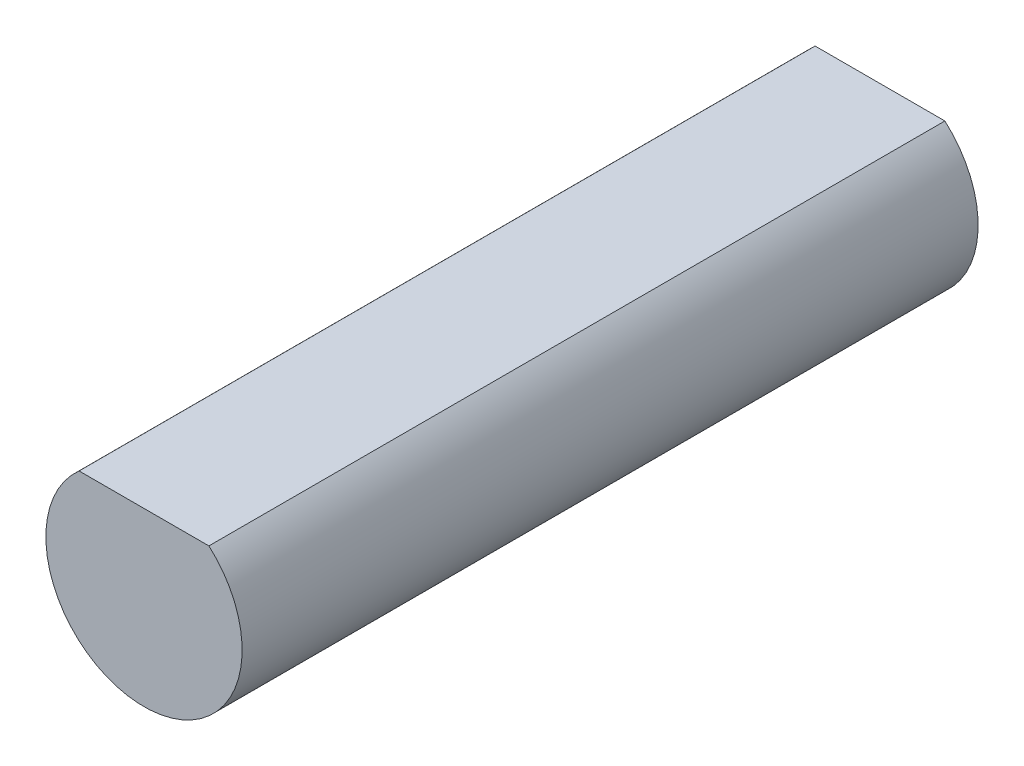
ISO-10303-21;
HEADER;
FILE_DESCRIPTION(('STEP AP214'),'2;1');
FILE_NAME('part.step','',(''),(''),'','','');
FILE_SCHEMA(('AUTOMOTIVE_DESIGN { 1 0 10303 214 1 1 1 1 }'));
ENDSEC;
DATA;
#1=APPLICATION_CONTEXT('core data for automotive mechanical design processes');
#2=APPLICATION_PROTOCOL_DEFINITION('international standard','automotive_design',2000,#1);
#3=PRODUCT_CONTEXT('',#1,'mechanical');
#4=PRODUCT('Part','Part','',(#3));
#5=PRODUCT_RELATED_PRODUCT_CATEGORY('part','',(#4));
#6=PRODUCT_DEFINITION_FORMATION('','',#4);
#7=PRODUCT_DEFINITION_CONTEXT('part definition',#1,'design');
#8=PRODUCT_DEFINITION('design','',#6,#7);
#9=PRODUCT_DEFINITION_SHAPE('','',#8);
#10=(LENGTH_UNIT() NAMED_UNIT(*) SI_UNIT(.MILLI.,.METRE.));
#11=(NAMED_UNIT(*) PLANE_ANGLE_UNIT() SI_UNIT($,.RADIAN.));
#12=(NAMED_UNIT(*) SI_UNIT($,.STERADIAN.) SOLID_ANGLE_UNIT());
#13=UNCERTAINTY_MEASURE_WITH_UNIT(LENGTH_MEASURE(1.E-05),#10,'distance_accuracy_value','');
#14=(GEOMETRIC_REPRESENTATION_CONTEXT(3) GLOBAL_UNCERTAINTY_ASSIGNED_CONTEXT((#13)) GLOBAL_UNIT_ASSIGNED_CONTEXT((#10,
#11,#12)) REPRESENTATION_CONTEXT('',''));
#15=CARTESIAN_POINT('',(0.,0.,0.));
#16=DIRECTION('',(0.,0.,1.));
#17=DIRECTION('',(1.,0.,0.));
#18=AXIS2_PLACEMENT_3D('',#15,#16,#17);
#19=CARTESIAN_POINT('',(0.,0.,-15.));
#20=DIRECTION('',(0.,0.,1.));
#21=DIRECTION('',(1.,0.,0.));
#22=AXIS2_PLACEMENT_3D('',#19,#20,#21);
#23=CYLINDRICAL_SURFACE('',#22,2.);
#24=CARTESIAN_POINT('',(0.,0.,0.));
#25=DIRECTION('',(0.,0.,1.));
#26=DIRECTION('',(1.,0.,0.));
#27=AXIS2_PLACEMENT_3D('',#24,#25,#26);
#28=CIRCLE('',#27,2.);
#29=CARTESIAN_POINT('',(-1.3228756555323,1.5,0.));
#30=VERTEX_POINT('',#29);
#31=CARTESIAN_POINT('',(1.32287565553229,1.5,0.));
#32=VERTEX_POINT('',#31);
#33=EDGE_CURVE('E69',#30,#32,#28,.T.);
#34=ORIENTED_EDGE('',*,*,#33,.F.);
#35=DIRECTION('',(0.,0.,1.));
#36=VECTOR('',#35,1.);
#37=CARTESIAN_POINT('',(-1.3228756555323,1.5,-15.));
#38=LINE('',#37,#36);
#39=CARTESIAN_POINT('',(-1.3228756555323,1.5,-15.));
#40=VERTEX_POINT('',#39);
#41=EDGE_CURVE('E11',#40,#30,#38,.T.);
#42=ORIENTED_EDGE('',*,*,#41,.F.);
#43=CARTESIAN_POINT('',(0.,0.,-15.));
#44=DIRECTION('',(0.,0.,1.));
#45=DIRECTION('',(1.,0.,0.));
#46=AXIS2_PLACEMENT_3D('',#43,#44,#45);
#47=CIRCLE('',#46,2.);
#48=CARTESIAN_POINT('',(1.32287565553229,1.5,-15.));
#49=VERTEX_POINT('',#48);
#50=EDGE_CURVE('E75',#40,#49,#47,.T.);
#51=ORIENTED_EDGE('',*,*,#50,.T.);
#52=DIRECTION('',(0.,0.,1.));
#53=VECTOR('',#52,1.);
#54=CARTESIAN_POINT('',(1.32287565553229,1.5,-15.));
#55=LINE('',#54,#53);
#56=EDGE_CURVE('E42',#49,#32,#55,.T.);
#57=ORIENTED_EDGE('',*,*,#56,.T.);
#58=EDGE_LOOP('',(#34,#42,#51,#57));
#59=FACE_BOUND('',#58,.T.);
#60=ADVANCED_FACE('F39',(#59),#23,.T.);
#61=CARTESIAN_POINT('',(1.32287565553229,1.5,-15.));
#62=DIRECTION('',(0.,1.,0.));
#63=DIRECTION('',(-1.,0.,0.));
#64=AXIS2_PLACEMENT_3D('',#61,#62,#63);
#65=PLANE('',#64);
#66=DIRECTION('',(-1.,0.,0.));
#67=VECTOR('',#66,1.);
#68=CARTESIAN_POINT('',(1.32287565553229,1.5,0.));
#69=LINE('',#68,#67);
#70=EDGE_CURVE('E66',#32,#30,#69,.T.);
#71=ORIENTED_EDGE('',*,*,#70,.F.);
#72=ORIENTED_EDGE('',*,*,#56,.F.);
#73=DIRECTION('',(-1.,0.,0.));
#74=VECTOR('',#73,1.);
#75=CARTESIAN_POINT('',(1.32287565553229,1.5,-15.));
#76=LINE('',#75,#74);
#77=EDGE_CURVE('E68',#49,#40,#76,.T.);
#78=ORIENTED_EDGE('',*,*,#77,.T.);
#79=ORIENTED_EDGE('',*,*,#41,.T.);
#80=EDGE_LOOP('',(#71,#72,#78,#79));
#81=FACE_BOUND('',#80,.T.);
#82=ADVANCED_FACE('F64',(#81),#65,.T.);
#83=CARTESIAN_POINT('',(0.,0.,-15.));
#84=DIRECTION('',(0.,0.,1.));
#85=DIRECTION('',(1.,0.,0.));
#86=AXIS2_PLACEMENT_3D('',#83,#84,#85);
#87=PLANE('',#86);
#88=ORIENTED_EDGE('',*,*,#50,.F.);
#89=ORIENTED_EDGE('',*,*,#77,.F.);
#90=EDGE_LOOP('',(#88,#89));
#91=FACE_BOUND('',#90,.T.);
#92=ADVANCED_FACE('F83',(#91),#87,.F.);
#93=CARTESIAN_POINT('',(0.,0.,0.));
#94=DIRECTION('',(0.,0.,1.));
#95=DIRECTION('',(1.,0.,0.));
#96=AXIS2_PLACEMENT_3D('',#93,#94,#95);
#97=PLANE('',#96);
#98=ORIENTED_EDGE('',*,*,#33,.T.);
#99=ORIENTED_EDGE('',*,*,#70,.T.);
#100=EDGE_LOOP('',(#98,#99));
#101=FACE_BOUND('',#100,.T.);
#102=ADVANCED_FACE('F73',(#101),#97,.T.);
#103=CLOSED_SHELL('',(#60,#82,#92,#102));
#104=MANIFOLD_SOLID_BREP('B2',#103);
#105=ADVANCED_BREP_SHAPE_REPRESENTATION('',(#18,#104),#14);
#106=SHAPE_DEFINITION_REPRESENTATION(#9,#105);
ENDSEC;
END-ISO-10303-21;
